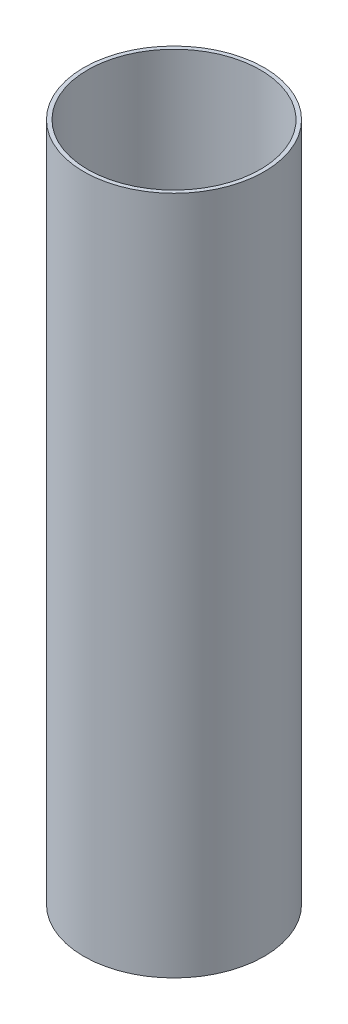
ISO-10303-21;
HEADER;
FILE_DESCRIPTION(('STEP AP214'),'2;1');
FILE_NAME('part.step','',(''),(''),'','','');
FILE_SCHEMA(('AUTOMOTIVE_DESIGN { 1 0 10303 214 1 1 1 1 }'));
ENDSEC;
DATA;
#1=APPLICATION_CONTEXT('core data for automotive mechanical design processes');
#2=APPLICATION_PROTOCOL_DEFINITION('international standard','automotive_design',2000,#1);
#3=PRODUCT_CONTEXT('',#1,'mechanical');
#4=PRODUCT('Part','Part','',(#3));
#5=PRODUCT_RELATED_PRODUCT_CATEGORY('part','',(#4));
#6=PRODUCT_DEFINITION_FORMATION('','',#4);
#7=PRODUCT_DEFINITION_CONTEXT('part definition',#1,'design');
#8=PRODUCT_DEFINITION('design','',#6,#7);
#9=PRODUCT_DEFINITION_SHAPE('','',#8);
#10=(LENGTH_UNIT() NAMED_UNIT(*) SI_UNIT(.MILLI.,.METRE.));
#11=(NAMED_UNIT(*) PLANE_ANGLE_UNIT() SI_UNIT($,.RADIAN.));
#12=(NAMED_UNIT(*) SI_UNIT($,.STERADIAN.) SOLID_ANGLE_UNIT());
#13=UNCERTAINTY_MEASURE_WITH_UNIT(LENGTH_MEASURE(1.E-05),#10,'distance_accuracy_value','');
#14=(GEOMETRIC_REPRESENTATION_CONTEXT(3) GLOBAL_UNCERTAINTY_ASSIGNED_CONTEXT((#13)) GLOBAL_UNIT_ASSIGNED_CONTEXT((#10,
#11,#12)) REPRESENTATION_CONTEXT('',''));
#15=CARTESIAN_POINT('',(0.,0.,0.));
#16=DIRECTION('',(0.,0.,1.));
#17=DIRECTION('',(1.,0.,0.));
#18=AXIS2_PLACEMENT_3D('',#15,#16,#17);
#19=CARTESIAN_POINT('',(0.,385.,0.));
#20=DIRECTION('',(0.,1.,0.));
#21=DIRECTION('',(0.,0.,1.));
#22=AXIS2_PLACEMENT_3D('',#19,#20,#21);
#23=PLANE('',#22);
#24=CARTESIAN_POINT('',(0.,385.,0.));
#25=DIRECTION('',(0.,1.,0.));
#26=DIRECTION('',(0.,0.,1.));
#27=AXIS2_PLACEMENT_3D('',#24,#25,#26);
#28=CIRCLE('',#27,51.1048);
#29=CARTESIAN_POINT('',(0.,385.,51.1048));
#30=VERTEX_POINT('',#29);
#31=EDGE_CURVE('E10',#30,#30,#28,.T.);
#32=ORIENTED_EDGE('',*,*,#31,.T.);
#33=EDGE_LOOP('',(#32));
#34=FACE_BOUND('',#33,.T.);
#35=CARTESIAN_POINT('',(0.,385.,0.));
#36=DIRECTION('',(0.,1.,0.));
#37=DIRECTION('',(0.,0.,1.));
#38=AXIS2_PLACEMENT_3D('',#35,#36,#37);
#39=CIRCLE('',#38,48.895);
#40=CARTESIAN_POINT('',(0.,385.,48.895));
#41=VERTEX_POINT('',#40);
#42=EDGE_CURVE('E48',#41,#41,#39,.T.);
#43=ORIENTED_EDGE('',*,*,#42,.F.);
#44=EDGE_LOOP('',(#43));
#45=FACE_BOUND('',#44,.T.);
#46=ADVANCED_FACE('F37',(#34,#45),#23,.T.);
#47=CARTESIAN_POINT('',(0.,0.,0.));
#48=DIRECTION('',(0.,1.,0.));
#49=DIRECTION('',(0.,0.,1.));
#50=AXIS2_PLACEMENT_3D('',#47,#48,#49);
#51=PLANE('',#50);
#52=CARTESIAN_POINT('',(0.,0.,0.));
#53=DIRECTION('',(0.,1.,0.));
#54=DIRECTION('',(0.,0.,1.));
#55=AXIS2_PLACEMENT_3D('',#52,#53,#54);
#56=CIRCLE('',#55,51.1048);
#57=CARTESIAN_POINT('',(0.,0.,51.1048));
#58=VERTEX_POINT('',#57);
#59=EDGE_CURVE('E41',#58,#58,#56,.T.);
#60=ORIENTED_EDGE('',*,*,#59,.F.);
#61=EDGE_LOOP('',(#60));
#62=FACE_BOUND('',#61,.T.);
#63=CARTESIAN_POINT('',(0.,0.,0.));
#64=DIRECTION('',(0.,1.,0.));
#65=DIRECTION('',(0.,0.,1.));
#66=AXIS2_PLACEMENT_3D('',#63,#64,#65);
#67=CIRCLE('',#66,48.895);
#68=CARTESIAN_POINT('',(0.,0.,48.895));
#69=VERTEX_POINT('',#68);
#70=EDGE_CURVE('E50',#69,#69,#67,.T.);
#71=ORIENTED_EDGE('',*,*,#70,.T.);
#72=EDGE_LOOP('',(#71));
#73=FACE_BOUND('',#72,.T.);
#74=ADVANCED_FACE('F60',(#62,#73),#51,.F.);
#75=CARTESIAN_POINT('',(0.,385.,0.));
#76=DIRECTION('',(0.,-1.,0.));
#77=DIRECTION('',(0.,0.,-1.));
#78=AXIS2_PLACEMENT_3D('',#75,#76,#77);
#79=CYLINDRICAL_SURFACE('',#78,51.1048);
#80=ORIENTED_EDGE('',*,*,#31,.F.);
#81=EDGE_LOOP('',(#80));
#82=FACE_BOUND('',#81,.T.);
#83=ORIENTED_EDGE('',*,*,#59,.T.);
#84=EDGE_LOOP('',(#83));
#85=FACE_BOUND('',#84,.T.);
#86=ADVANCED_FACE('F39',(#82,#85),#79,.T.);
#87=CARTESIAN_POINT('',(0.,385.,0.));
#88=DIRECTION('',(0.,-1.,0.));
#89=DIRECTION('',(0.,0.,-1.));
#90=AXIS2_PLACEMENT_3D('',#87,#88,#89);
#91=CYLINDRICAL_SURFACE('',#90,48.895);
#92=ORIENTED_EDGE('',*,*,#42,.T.);
#93=EDGE_LOOP('',(#92));
#94=FACE_BOUND('',#93,.T.);
#95=ORIENTED_EDGE('',*,*,#70,.F.);
#96=EDGE_LOOP('',(#95));
#97=FACE_BOUND('',#96,.T.);
#98=ADVANCED_FACE('F56',(#94,#97),#91,.F.);
#99=CLOSED_SHELL('',(#46,#74,#86,#98));
#100=MANIFOLD_SOLID_BREP('B2',#99);
#101=ADVANCED_BREP_SHAPE_REPRESENTATION('',(#18,#100),#14);
#102=SHAPE_DEFINITION_REPRESENTATION(#9,#101);
ENDSEC;
END-ISO-10303-21;
